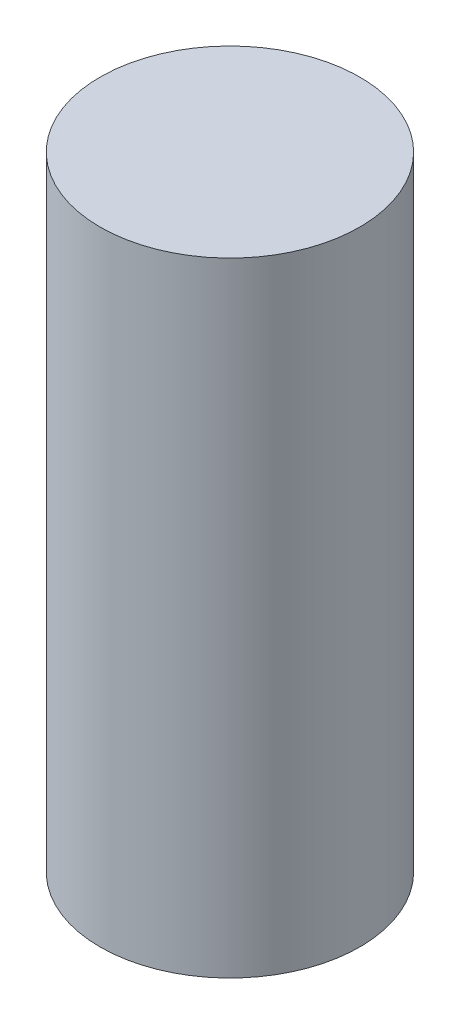
ISO-10303-21;
HEADER;
FILE_DESCRIPTION(('STEP AP214'),'2;1');
FILE_NAME('part.step','',(''),(''),'','','');
FILE_SCHEMA(('AUTOMOTIVE_DESIGN { 1 0 10303 214 1 1 1 1 }'));
ENDSEC;
DATA;
#1=APPLICATION_CONTEXT('core data for automotive mechanical design processes');
#2=APPLICATION_PROTOCOL_DEFINITION('international standard','automotive_design',2000,#1);
#3=PRODUCT_CONTEXT('',#1,'mechanical');
#4=PRODUCT('Part','Part','',(#3));
#5=PRODUCT_RELATED_PRODUCT_CATEGORY('part','',(#4));
#6=PRODUCT_DEFINITION_FORMATION('','',#4);
#7=PRODUCT_DEFINITION_CONTEXT('part definition',#1,'design');
#8=PRODUCT_DEFINITION('design','',#6,#7);
#9=PRODUCT_DEFINITION_SHAPE('','',#8);
#10=(LENGTH_UNIT() NAMED_UNIT(*) SI_UNIT(.MILLI.,.METRE.));
#11=(NAMED_UNIT(*) PLANE_ANGLE_UNIT() SI_UNIT($,.RADIAN.));
#12=(NAMED_UNIT(*) SI_UNIT($,.STERADIAN.) SOLID_ANGLE_UNIT());
#13=UNCERTAINTY_MEASURE_WITH_UNIT(LENGTH_MEASURE(1.E-05),#10,'distance_accuracy_value','');
#14=(GEOMETRIC_REPRESENTATION_CONTEXT(3) GLOBAL_UNCERTAINTY_ASSIGNED_CONTEXT((#13)) GLOBAL_UNIT_ASSIGNED_CONTEXT((#10,
#11,#12)) REPRESENTATION_CONTEXT('',''));
#15=CARTESIAN_POINT('',(0.,0.,0.));
#16=DIRECTION('',(0.,0.,1.));
#17=DIRECTION('',(1.,0.,0.));
#18=AXIS2_PLACEMENT_3D('',#15,#16,#17);
#19=CARTESIAN_POINT('',(0.,16.125,0.));
#20=DIRECTION('',(0.,-1.,0.));
#21=DIRECTION('',(0.,0.,-1.));
#22=AXIS2_PLACEMENT_3D('',#19,#20,#21);
#23=PLANE('',#22);
#24=CARTESIAN_POINT('',(0.,16.125,0.));
#25=DIRECTION('',(0.,1.,0.));
#26=DIRECTION('',(0.,0.,1.));
#27=AXIS2_PLACEMENT_3D('',#24,#25,#26);
#28=CIRCLE('',#27,1.);
#29=CARTESIAN_POINT('',(0.,16.125,1.));
#30=VERTEX_POINT('',#29);
#31=EDGE_CURVE('E10',#30,#30,#28,.T.);
#32=ORIENTED_EDGE('',*,*,#31,.T.);
#33=EDGE_LOOP('',(#32));
#34=FACE_BOUND('',#33,.T.);
#35=ADVANCED_FACE('F29',(#34),#23,.F.);
#36=CARTESIAN_POINT('',(0.,-50.,0.));
#37=DIRECTION('',(0.,1.,0.));
#38=DIRECTION('',(0.,0.,1.));
#39=AXIS2_PLACEMENT_3D('',#36,#37,#38);
#40=CYLINDRICAL_SURFACE('',#39,1.);
#41=ORIENTED_EDGE('',*,*,#31,.F.);
#42=EDGE_LOOP('',(#41));
#43=FACE_BOUND('',#42,.T.);
#44=CARTESIAN_POINT('',(0.,11.325,0.));
#45=DIRECTION('',(0.,1.,0.));
#46=DIRECTION('',(0.,0.,1.));
#47=AXIS2_PLACEMENT_3D('',#44,#45,#46);
#48=CIRCLE('',#47,1.);
#49=CARTESIAN_POINT('',(0.,11.325,1.));
#50=VERTEX_POINT('',#49);
#51=EDGE_CURVE('E35',#50,#50,#48,.T.);
#52=ORIENTED_EDGE('',*,*,#51,.T.);
#53=EDGE_LOOP('',(#52));
#54=FACE_BOUND('',#53,.T.);
#55=ADVANCED_FACE('F41',(#43,#54),#40,.T.);
#56=CARTESIAN_POINT('',(1.,11.325,0.));
#57=DIRECTION('',(0.,1.,0.));
#58=DIRECTION('',(0.,0.,1.));
#59=AXIS2_PLACEMENT_3D('',#56,#57,#58);
#60=PLANE('',#59);
#61=ORIENTED_EDGE('',*,*,#51,.F.);
#62=EDGE_LOOP('',(#61));
#63=FACE_BOUND('',#62,.T.);
#64=ADVANCED_FACE('F43',(#63),#60,.F.);
#65=CLOSED_SHELL('',(#35,#55,#64));
#66=MANIFOLD_SOLID_BREP('B2',#65);
#67=ADVANCED_BREP_SHAPE_REPRESENTATION('',(#18,#66),#14);
#68=SHAPE_DEFINITION_REPRESENTATION(#9,#67);
ENDSEC;
END-ISO-10303-21;
